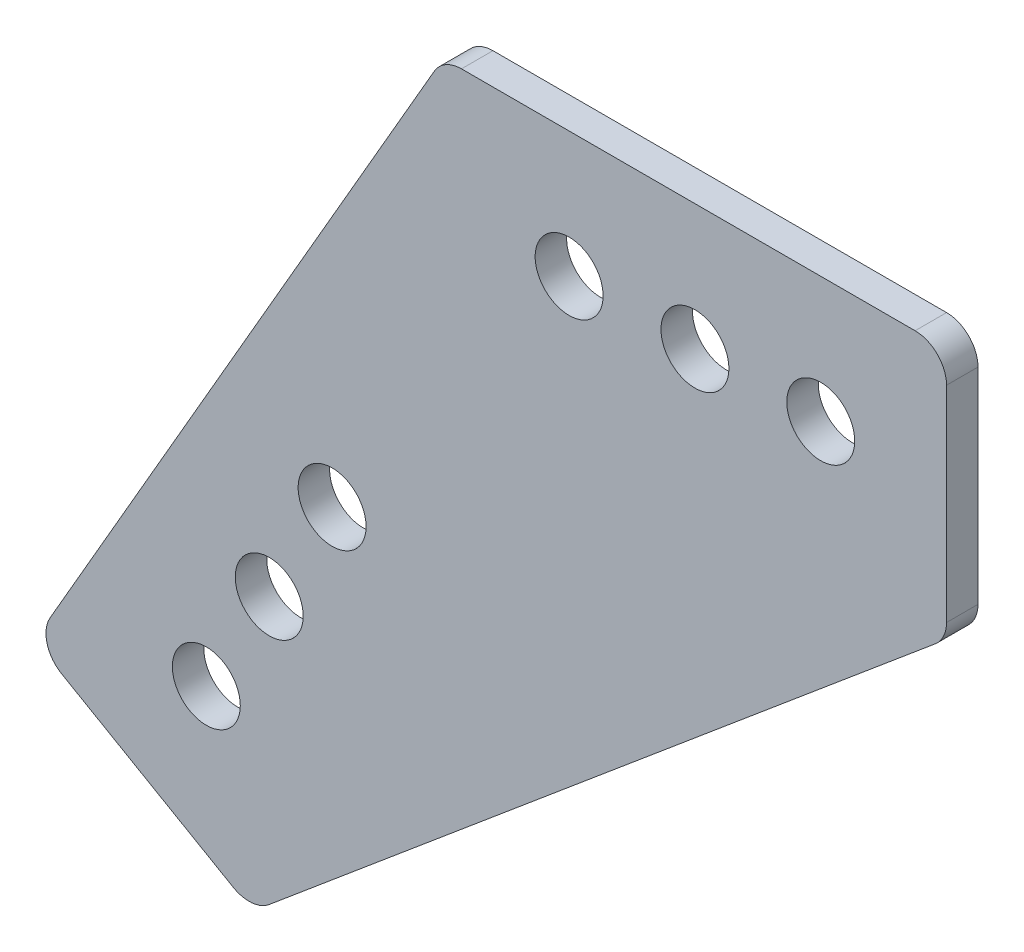
ISO-10303-21;
HEADER;
FILE_DESCRIPTION(('STEP AP214'),'2;1');
FILE_NAME('part.step','',(''),(''),'','','');
FILE_SCHEMA(('AUTOMOTIVE_DESIGN { 1 0 10303 214 1 1 1 1 }'));
ENDSEC;
DATA;
#1=APPLICATION_CONTEXT('core data for automotive mechanical design processes');
#2=APPLICATION_PROTOCOL_DEFINITION('international standard','automotive_design',2000,#1);
#3=PRODUCT_CONTEXT('',#1,'mechanical');
#4=PRODUCT('Part','Part','',(#3));
#5=PRODUCT_RELATED_PRODUCT_CATEGORY('part','',(#4));
#6=PRODUCT_DEFINITION_FORMATION('','',#4);
#7=PRODUCT_DEFINITION_CONTEXT('part definition',#1,'design');
#8=PRODUCT_DEFINITION('design','',#6,#7);
#9=PRODUCT_DEFINITION_SHAPE('','',#8);
#10=(LENGTH_UNIT() NAMED_UNIT(*) SI_UNIT(.MILLI.,.METRE.));
#11=(NAMED_UNIT(*) PLANE_ANGLE_UNIT() SI_UNIT($,.RADIAN.));
#12=(NAMED_UNIT(*) SI_UNIT($,.STERADIAN.) SOLID_ANGLE_UNIT());
#13=UNCERTAINTY_MEASURE_WITH_UNIT(LENGTH_MEASURE(1.E-05),#10,'distance_accuracy_value','');
#14=(GEOMETRIC_REPRESENTATION_CONTEXT(3) GLOBAL_UNCERTAINTY_ASSIGNED_CONTEXT((#13)) GLOBAL_UNIT_ASSIGNED_CONTEXT((#10,
#11,#12)) REPRESENTATION_CONTEXT('',''));
#15=CARTESIAN_POINT('',(0.,0.,0.));
#16=DIRECTION('',(0.,0.,1.));
#17=DIRECTION('',(1.,0.,0.));
#18=AXIS2_PLACEMENT_3D('',#15,#16,#17);
#19=CARTESIAN_POINT('',(0.,0.,3.175));
#20=DIRECTION('',(0.,0.,-1.));
#21=DIRECTION('',(-1.,0.,0.));
#22=AXIS2_PLACEMENT_3D('',#19,#20,#21);
#23=PLANE('',#22);
#24=DIRECTION('',(-0.500000000000004,-0.866025403784436,0.));
#25=VECTOR('',#24,1.);
#26=CARTESIAN_POINT('',(0.,0.,3.175));
#27=LINE('',#26,#25);
#28=CARTESIAN_POINT('',(-0.916543552338534,-1.58749999999999,3.175));
#29=VERTEX_POINT('',#28);
#30=CARTESIAN_POINT('',(-39.6875000000003,-68.7407664253897,3.175));
#31=VERTEX_POINT('',#30);
#32=EDGE_CURVE('E161',#29,#31,#27,.T.);
#33=ORIENTED_EDGE('',*,*,#32,.T.);
#34=CARTESIAN_POINT('',(-36.9378693429847,-70.3282664253897,3.175));
#35=DIRECTION('',(0.,0.,-1.));
#36=DIRECTION('',(-1.,0.,0.));
#37=AXIS2_PLACEMENT_3D('',#34,#35,#36);
#38=CIRCLE('',#37,3.175);
#39=CARTESIAN_POINT('',(-38.5253693429847,-73.0778970824052,3.175));
#40=VERTEX_POINT('',#39);
#41=EDGE_CURVE('E180',#31,#40,#38,.F.);
#42=ORIENTED_EDGE('',*,*,#41,.T.);
#43=DIRECTION('',(0.866025403784436,-0.500000000000004,0.));
#44=VECTOR('',#43,1.);
#45=CARTESIAN_POINT('',(-19.2779547438756,-84.1903970824053,3.175));
#46=LINE('',#45,#44);
#47=CARTESIAN_POINT('',(-21.2030611533773,-83.0789363786609,3.175));
#48=VERTEX_POINT('',#47);
#49=EDGE_CURVE('E140',#40,#48,#46,.T.);
#50=ORIENTED_EDGE('',*,*,#49,.T.);
#51=CARTESIAN_POINT('',(-19.6155611533773,-80.3293057216453,3.175));
#52=DIRECTION('',(0.,0.,-1.));
#53=DIRECTION('',(-1.,0.,0.));
#54=AXIS2_PLACEMENT_3D('',#51,#52,#53);
#55=CIRCLE('',#54,3.175);
#56=CARTESIAN_POINT('',(-17.5749546997371,-82.7617017217576,3.175));
#57=VERTEX_POINT('',#56);
#58=EDGE_CURVE('E178',#48,#57,#55,.F.);
#59=ORIENTED_EDGE('',*,*,#58,.T.);
#60=DIRECTION('',(0.766108976413314,0.642710694059889,0.));
#61=VECTOR('',#60,1.);
#62=CARTESIAN_POINT('',(-19.2779547438756,-84.1903970824053,3.175));
#63=LINE('',#62,#61);
#64=CARTESIAN_POINT('',(49.6656064536402,-26.3516751349545,3.175));
#65=VERTEX_POINT('',#64);
#66=EDGE_CURVE('E206',#57,#65,#63,.T.);
#67=ORIENTED_EDGE('',*,*,#66,.T.);
#68=CARTESIAN_POINT('',(47.625,-23.9192791348422,3.175));
#69=DIRECTION('',(0.,0.,-1.));
#70=DIRECTION('',(-1.,0.,0.));
#71=AXIS2_PLACEMENT_3D('',#68,#69,#70);
#72=CIRCLE('',#71,3.175);
#73=CARTESIAN_POINT('',(50.8,-23.9192791348422,3.175));
#74=VERTEX_POINT('',#73);
#75=EDGE_CURVE('E176',#65,#74,#72,.F.);
#76=ORIENTED_EDGE('',*,*,#75,.T.);
#77=DIRECTION('',(0.,1.,0.));
#78=VECTOR('',#77,1.);
#79=CARTESIAN_POINT('',(50.8,-25.4,3.175));
#80=LINE('',#79,#78);
#81=CARTESIAN_POINT('',(50.8,-3.175,3.175));
#82=VERTEX_POINT('',#81);
#83=EDGE_CURVE('E197',#74,#82,#80,.T.);
#84=ORIENTED_EDGE('',*,*,#83,.T.);
#85=CARTESIAN_POINT('',(47.625,-3.175,3.175));
#86=DIRECTION('',(0.,0.,-1.));
#87=DIRECTION('',(-1.,0.,0.));
#88=AXIS2_PLACEMENT_3D('',#85,#86,#87);
#89=CIRCLE('',#88,3.175);
#90=CARTESIAN_POINT('',(47.625,0.,3.175));
#91=VERTEX_POINT('',#90);
#92=EDGE_CURVE('E63',#82,#91,#89,.F.);
#93=ORIENTED_EDGE('',*,*,#92,.T.);
#94=DIRECTION('',(-1.,0.,0.));
#95=VECTOR('',#94,1.);
#96=CARTESIAN_POINT('',(0.,0.,3.175));
#97=LINE('',#96,#95);
#98=CARTESIAN_POINT('',(1.83308710467705,0.,3.175));
#99=VERTEX_POINT('',#98);
#100=EDGE_CURVE('E162',#91,#99,#97,.T.);
#101=ORIENTED_EDGE('',*,*,#100,.T.);
#102=CARTESIAN_POINT('',(1.83308710467705,-3.175,3.175));
#103=DIRECTION('',(0.,0.,-1.));
#104=DIRECTION('',(-1.,0.,0.));
#105=AXIS2_PLACEMENT_3D('',#102,#103,#104);
#106=CIRCLE('',#105,3.175);
#107=EDGE_CURVE('E173',#99,#29,#106,.F.);
#108=ORIENTED_EDGE('',*,*,#107,.T.);
#109=EDGE_LOOP('',(#33,#42,#50,#59,#67,#76,#84,#93,#101,#108));
#110=FACE_BOUND('',#109,.T.);
#111=CARTESIAN_POINT('',(38.1,-12.7,3.175));
#112=DIRECTION('',(0.,0.,1.));
#113=DIRECTION('',(1.,0.,0.));
#114=AXIS2_PLACEMENT_3D('',#111,#112,#113);
#115=CIRCLE('',#114,3.429);
#116=CARTESIAN_POINT('',(41.529,-12.7,3.175));
#117=VERTEX_POINT('',#116);
#118=EDGE_CURVE('E153',#117,#117,#115,.T.);
#119=ORIENTED_EDGE('',*,*,#118,.F.);
#120=EDGE_LOOP('',(#119));
#121=FACE_BOUND('',#120,.T.);
#122=CARTESIAN_POINT('',(25.4,-12.7000000000001,3.175));
#123=DIRECTION('',(0.,0.,1.));
#124=DIRECTION('',(1.,0.,0.));
#125=AXIS2_PLACEMENT_3D('',#122,#123,#124);
#126=CIRCLE('',#125,3.429);
#127=CARTESIAN_POINT('',(28.829,-12.7000000000001,3.175));
#128=VERTEX_POINT('',#127);
#129=EDGE_CURVE('E217',#128,#128,#126,.T.);
#130=ORIENTED_EDGE('',*,*,#129,.F.);
#131=EDGE_LOOP('',(#130));
#132=FACE_BOUND('',#131,.T.);
#133=CARTESIAN_POINT('',(12.7,-12.7000000000002,3.175));
#134=DIRECTION('',(0.,0.,1.));
#135=DIRECTION('',(1.,0.,0.));
#136=AXIS2_PLACEMENT_3D('',#133,#134,#135);
#137=CIRCLE('',#136,3.429);
#138=CARTESIAN_POINT('',(16.129,-12.7000000000002,3.175));
#139=VERTEX_POINT('',#138);
#140=EDGE_CURVE('E223',#139,#139,#137,.T.);
#141=ORIENTED_EDGE('',*,*,#140,.F.);
#142=EDGE_LOOP('',(#141));
#143=FACE_BOUND('',#142,.T.);
#144=CARTESIAN_POINT('',(-23.9264773719379,-66.8418744543429,3.175));
#145=DIRECTION('',(0.,0.,1.));
#146=DIRECTION('',(1.,0.,0.));
#147=AXIS2_PLACEMENT_3D('',#144,#145,#146);
#148=CIRCLE('',#147,3.42900000000001);
#149=CARTESIAN_POINT('',(-20.4974773719379,-66.8418744543429,3.175));
#150=VERTEX_POINT('',#149);
#151=EDGE_CURVE('E229',#150,#150,#148,.T.);
#152=ORIENTED_EDGE('',*,*,#151,.F.);
#153=EDGE_LOOP('',(#152));
#154=FACE_BOUND('',#153,.T.);
#155=CARTESIAN_POINT('',(-17.5764773719379,-55.8433518262806,3.175));
#156=DIRECTION('',(0.,0.,1.));
#157=DIRECTION('',(1.,0.,0.));
#158=AXIS2_PLACEMENT_3D('',#155,#156,#157);
#159=CIRCLE('',#158,3.42900000000001);
#160=CARTESIAN_POINT('',(-14.1474773719379,-55.8433518262806,3.175));
#161=VERTEX_POINT('',#160);
#162=EDGE_CURVE('E235',#161,#161,#159,.T.);
#163=ORIENTED_EDGE('',*,*,#162,.F.);
#164=EDGE_LOOP('',(#163));
#165=FACE_BOUND('',#164,.T.);
#166=CARTESIAN_POINT('',(-11.2264773719378,-44.8448291982183,3.175));
#167=DIRECTION('',(0.,0.,1.));
#168=DIRECTION('',(1.,0.,0.));
#169=AXIS2_PLACEMENT_3D('',#166,#167,#168);
#170=CIRCLE('',#169,3.429);
#171=CARTESIAN_POINT('',(-7.7974773719378,-44.8448291982183,3.175));
#172=VERTEX_POINT('',#171);
#173=EDGE_CURVE('E241',#172,#172,#170,.T.);
#174=ORIENTED_EDGE('',*,*,#173,.F.);
#175=EDGE_LOOP('',(#174));
#176=FACE_BOUND('',#175,.T.);
#177=ADVANCED_FACE('F42',(#110,#121,#132,#143,#154,#165,#176),#23,.F.);
#178=CARTESIAN_POINT('',(0.,0.,0.));
#179=DIRECTION('',(0.,0.,-1.));
#180=DIRECTION('',(-1.,0.,0.));
#181=AXIS2_PLACEMENT_3D('',#178,#179,#180);
#182=PLANE('',#181);
#183=CARTESIAN_POINT('',(-17.5764773719379,-55.8433518262806,0.));
#184=DIRECTION('',(0.,0.,1.));
#185=DIRECTION('',(1.,0.,0.));
#186=AXIS2_PLACEMENT_3D('',#183,#184,#185);
#187=CIRCLE('',#186,3.42900000000001);
#188=CARTESIAN_POINT('',(-14.1474773719379,-55.8433518262806,0.));
#189=VERTEX_POINT('',#188);
#190=EDGE_CURVE('E238',#189,#189,#187,.T.);
#191=ORIENTED_EDGE('',*,*,#190,.T.);
#192=EDGE_LOOP('',(#191));
#193=FACE_BOUND('',#192,.T.);
#194=CARTESIAN_POINT('',(12.7,-12.7000000000002,0.));
#195=DIRECTION('',(0.,0.,1.));
#196=DIRECTION('',(1.,0.,0.));
#197=AXIS2_PLACEMENT_3D('',#194,#195,#196);
#198=CIRCLE('',#197,3.429);
#199=CARTESIAN_POINT('',(16.129,-12.7000000000002,0.));
#200=VERTEX_POINT('',#199);
#201=EDGE_CURVE('E226',#200,#200,#198,.T.);
#202=ORIENTED_EDGE('',*,*,#201,.T.);
#203=EDGE_LOOP('',(#202));
#204=FACE_BOUND('',#203,.T.);
#205=CARTESIAN_POINT('',(38.1,-12.7,0.));
#206=DIRECTION('',(0.,0.,1.));
#207=DIRECTION('',(1.,0.,0.));
#208=AXIS2_PLACEMENT_3D('',#205,#206,#207);
#209=CIRCLE('',#208,3.429);
#210=CARTESIAN_POINT('',(41.529,-12.7,0.));
#211=VERTEX_POINT('',#210);
#212=EDGE_CURVE('E214',#211,#211,#209,.T.);
#213=ORIENTED_EDGE('',*,*,#212,.T.);
#214=EDGE_LOOP('',(#213));
#215=FACE_BOUND('',#214,.T.);
#216=DIRECTION('',(0.866025403784436,-0.500000000000004,0.));
#217=VECTOR('',#216,1.);
#218=CARTESIAN_POINT('',(-19.2779547438756,-84.1903970824053,0.));
#219=LINE('',#218,#217);
#220=CARTESIAN_POINT('',(-38.5253693429847,-73.0778970824052,0.));
#221=VERTEX_POINT('',#220);
#222=CARTESIAN_POINT('',(-21.2030611533773,-83.0789363786609,0.));
#223=VERTEX_POINT('',#222);
#224=EDGE_CURVE('E137',#221,#223,#219,.T.);
#225=ORIENTED_EDGE('',*,*,#224,.F.);
#226=CARTESIAN_POINT('',(-36.9378693429847,-70.3282664253897,0.));
#227=DIRECTION('',(0.,0.,-1.));
#228=DIRECTION('',(-1.,0.,0.));
#229=AXIS2_PLACEMENT_3D('',#226,#227,#228);
#230=CIRCLE('',#229,3.175);
#231=CARTESIAN_POINT('',(-39.6875000000003,-68.7407664253897,0.));
#232=VERTEX_POINT('',#231);
#233=EDGE_CURVE('E120',#221,#232,#230,.T.);
#234=ORIENTED_EDGE('',*,*,#233,.T.);
#235=DIRECTION('',(-0.500000000000004,-0.866025403784436,0.));
#236=VECTOR('',#235,1.);
#237=CARTESIAN_POINT('',(0.,0.,0.));
#238=LINE('',#237,#236);
#239=CARTESIAN_POINT('',(-0.916543552338534,-1.58749999999999,0.));
#240=VERTEX_POINT('',#239);
#241=EDGE_CURVE('E148',#240,#232,#238,.T.);
#242=ORIENTED_EDGE('',*,*,#241,.F.);
#243=CARTESIAN_POINT('',(1.83308710467705,-3.175,0.));
#244=DIRECTION('',(0.,0.,-1.));
#245=DIRECTION('',(-1.,0.,0.));
#246=AXIS2_PLACEMENT_3D('',#243,#244,#245);
#247=CIRCLE('',#246,3.175);
#248=CARTESIAN_POINT('',(1.83308710467705,0.,0.));
#249=VERTEX_POINT('',#248);
#250=EDGE_CURVE('E141',#240,#249,#247,.T.);
#251=ORIENTED_EDGE('',*,*,#250,.T.);
#252=DIRECTION('',(-1.,0.,0.));
#253=VECTOR('',#252,1.);
#254=CARTESIAN_POINT('',(0.,0.,0.));
#255=LINE('',#254,#253);
#256=CARTESIAN_POINT('',(47.625,0.,0.));
#257=VERTEX_POINT('',#256);
#258=EDGE_CURVE('E159',#257,#249,#255,.T.);
#259=ORIENTED_EDGE('',*,*,#258,.F.);
#260=CARTESIAN_POINT('',(47.625,-3.175,0.));
#261=DIRECTION('',(0.,0.,-1.));
#262=DIRECTION('',(-1.,0.,0.));
#263=AXIS2_PLACEMENT_3D('',#260,#261,#262);
#264=CIRCLE('',#263,3.175);
#265=CARTESIAN_POINT('',(50.8,-3.175,0.));
#266=VERTEX_POINT('',#265);
#267=EDGE_CURVE('E165',#257,#266,#264,.T.);
#268=ORIENTED_EDGE('',*,*,#267,.T.);
#269=DIRECTION('',(0.,1.,0.));
#270=VECTOR('',#269,1.);
#271=CARTESIAN_POINT('',(50.8,-25.4,0.));
#272=LINE('',#271,#270);
#273=CARTESIAN_POINT('',(50.8,-23.9192791348422,0.));
#274=VERTEX_POINT('',#273);
#275=EDGE_CURVE('E151',#274,#266,#272,.T.);
#276=ORIENTED_EDGE('',*,*,#275,.F.);
#277=CARTESIAN_POINT('',(47.625,-23.9192791348422,0.));
#278=DIRECTION('',(0.,0.,-1.));
#279=DIRECTION('',(-1.,0.,0.));
#280=AXIS2_PLACEMENT_3D('',#277,#278,#279);
#281=CIRCLE('',#280,3.175);
#282=CARTESIAN_POINT('',(49.6656064536402,-26.3516751349545,0.));
#283=VERTEX_POINT('',#282);
#284=EDGE_CURVE('E167',#274,#283,#281,.T.);
#285=ORIENTED_EDGE('',*,*,#284,.T.);
#286=DIRECTION('',(0.766108976413314,0.642710694059889,0.));
#287=VECTOR('',#286,1.);
#288=CARTESIAN_POINT('',(-19.2779547438756,-84.1903970824053,0.));
#289=LINE('',#288,#287);
#290=CARTESIAN_POINT('',(-17.5749546997371,-82.7617017217576,0.));
#291=VERTEX_POINT('',#290);
#292=EDGE_CURVE('E147',#291,#283,#289,.T.);
#293=ORIENTED_EDGE('',*,*,#292,.F.);
#294=CARTESIAN_POINT('',(-19.6155611533773,-80.3293057216453,0.));
#295=DIRECTION('',(0.,0.,-1.));
#296=DIRECTION('',(-1.,0.,0.));
#297=AXIS2_PLACEMENT_3D('',#294,#295,#296);
#298=CIRCLE('',#297,3.175);
#299=EDGE_CURVE('E131',#291,#223,#298,.T.);
#300=ORIENTED_EDGE('',*,*,#299,.T.);
#301=EDGE_LOOP('',(#225,#234,#242,#251,#259,#268,#276,#285,#293,#300));
#302=FACE_BOUND('',#301,.T.);
#303=CARTESIAN_POINT('',(25.4,-12.7000000000001,0.));
#304=DIRECTION('',(0.,0.,1.));
#305=DIRECTION('',(1.,0.,0.));
#306=AXIS2_PLACEMENT_3D('',#303,#304,#305);
#307=CIRCLE('',#306,3.429);
#308=CARTESIAN_POINT('',(28.829,-12.7000000000001,0.));
#309=VERTEX_POINT('',#308);
#310=EDGE_CURVE('E220',#309,#309,#307,.T.);
#311=ORIENTED_EDGE('',*,*,#310,.T.);
#312=EDGE_LOOP('',(#311));
#313=FACE_BOUND('',#312,.T.);
#314=CARTESIAN_POINT('',(-23.9264773719379,-66.8418744543429,0.));
#315=DIRECTION('',(0.,0.,1.));
#316=DIRECTION('',(1.,0.,0.));
#317=AXIS2_PLACEMENT_3D('',#314,#315,#316);
#318=CIRCLE('',#317,3.42900000000001);
#319=CARTESIAN_POINT('',(-20.4974773719379,-66.8418744543429,0.));
#320=VERTEX_POINT('',#319);
#321=EDGE_CURVE('E232',#320,#320,#318,.T.);
#322=ORIENTED_EDGE('',*,*,#321,.T.);
#323=EDGE_LOOP('',(#322));
#324=FACE_BOUND('',#323,.T.);
#325=CARTESIAN_POINT('',(-11.2264773719378,-44.8448291982183,0.));
#326=DIRECTION('',(0.,0.,1.));
#327=DIRECTION('',(1.,0.,0.));
#328=AXIS2_PLACEMENT_3D('',#325,#326,#327);
#329=CIRCLE('',#328,3.429);
#330=CARTESIAN_POINT('',(-7.7974773719378,-44.8448291982183,0.));
#331=VERTEX_POINT('',#330);
#332=EDGE_CURVE('E244',#331,#331,#329,.T.);
#333=ORIENTED_EDGE('',*,*,#332,.T.);
#334=EDGE_LOOP('',(#333));
#335=FACE_BOUND('',#334,.T.);
#336=ADVANCED_FACE('F144',(#193,#204,#215,#302,#313,#324,#335),#182,.T.);
#337=CARTESIAN_POINT('',(0.,0.,3.175));
#338=DIRECTION('',(0.866025403784436,-0.500000000000004,0.));
#339=DIRECTION('',(0.500000000000004,0.866025403784436,0.));
#340=AXIS2_PLACEMENT_3D('',#337,#338,#339);
#341=PLANE('',#340);
#342=ORIENTED_EDGE('',*,*,#241,.T.);
#343=DIRECTION('',(0.,0.,-1.));
#344=VECTOR('',#343,1.);
#345=CARTESIAN_POINT('',(-39.6875000000003,-68.7407664253896,3.175));
#346=LINE('',#345,#344);
#347=EDGE_CURVE('E125',#232,#31,#346,.F.);
#348=ORIENTED_EDGE('',*,*,#347,.T.);
#349=ORIENTED_EDGE('',*,*,#32,.F.);
#350=DIRECTION('',(0.,0.,-1.));
#351=VECTOR('',#350,1.);
#352=CARTESIAN_POINT('',(-0.916543552338533,-1.58749999999999,3.175));
#353=LINE('',#352,#351);
#354=EDGE_CURVE('E130',#29,#240,#353,.T.);
#355=ORIENTED_EDGE('',*,*,#354,.T.);
#356=EDGE_LOOP('',(#342,#348,#349,#355));
#357=FACE_BOUND('',#356,.T.);
#358=ADVANCED_FACE('F259',(#357),#341,.F.);
#359=CARTESIAN_POINT('',(-19.2779547438756,-84.1903970824053,3.175));
#360=DIRECTION('',(0.500000000000004,0.866025403784436,0.));
#361=DIRECTION('',(-0.866025403784437,0.500000000000004,0.));
#362=AXIS2_PLACEMENT_3D('',#359,#360,#361);
#363=PLANE('',#362);
#364=ORIENTED_EDGE('',*,*,#49,.F.);
#365=DIRECTION('',(0.,0.,-1.));
#366=VECTOR('',#365,1.);
#367=CARTESIAN_POINT('',(-38.5253693429847,-73.0778970824052,3.175));
#368=LINE('',#367,#366);
#369=EDGE_CURVE('E124',#40,#221,#368,.T.);
#370=ORIENTED_EDGE('',*,*,#369,.T.);
#371=ORIENTED_EDGE('',*,*,#224,.T.);
#372=DIRECTION('',(0.,0.,-1.));
#373=VECTOR('',#372,1.);
#374=CARTESIAN_POINT('',(-21.2030611533773,-83.0789363786609,3.175));
#375=LINE('',#374,#373);
#376=EDGE_CURVE('E142',#223,#48,#375,.F.);
#377=ORIENTED_EDGE('',*,*,#376,.T.);
#378=EDGE_LOOP('',(#364,#370,#371,#377));
#379=FACE_BOUND('',#378,.T.);
#380=ADVANCED_FACE('F136',(#379),#363,.F.);
#381=CARTESIAN_POINT('',(-19.2779547438756,-84.1903970824053,3.175));
#382=DIRECTION('',(-0.642710694059889,0.766108976413314,0.));
#383=DIRECTION('',(-0.766108976413314,-0.642710694059889,0.));
#384=AXIS2_PLACEMENT_3D('',#381,#382,#383);
#385=PLANE('',#384);
#386=ORIENTED_EDGE('',*,*,#66,.F.);
#387=DIRECTION('',(0.,0.,-1.));
#388=VECTOR('',#387,1.);
#389=CARTESIAN_POINT('',(-17.5749546997371,-82.7617017217576,3.175));
#390=LINE('',#389,#388);
#391=EDGE_CURVE('E184',#57,#291,#390,.T.);
#392=ORIENTED_EDGE('',*,*,#391,.T.);
#393=ORIENTED_EDGE('',*,*,#292,.T.);
#394=DIRECTION('',(0.,0.,-1.));
#395=VECTOR('',#394,1.);
#396=CARTESIAN_POINT('',(49.6656064536402,-26.3516751349545,3.175));
#397=LINE('',#396,#395);
#398=EDGE_CURVE('E182',#283,#65,#397,.F.);
#399=ORIENTED_EDGE('',*,*,#398,.T.);
#400=EDGE_LOOP('',(#386,#392,#393,#399));
#401=FACE_BOUND('',#400,.T.);
#402=ADVANCED_FACE('F271',(#401),#385,.F.);
#403=CARTESIAN_POINT('',(50.8,-25.4,3.175));
#404=DIRECTION('',(-1.,0.,0.));
#405=DIRECTION('',(0.,0.,1.));
#406=AXIS2_PLACEMENT_3D('',#403,#404,#405);
#407=PLANE('',#406);
#408=ORIENTED_EDGE('',*,*,#83,.F.);
#409=DIRECTION('',(0.,0.,-1.));
#410=VECTOR('',#409,1.);
#411=CARTESIAN_POINT('',(50.8,-23.9192791348422,3.175));
#412=LINE('',#411,#410);
#413=EDGE_CURVE('E189',#74,#274,#412,.T.);
#414=ORIENTED_EDGE('',*,*,#413,.T.);
#415=ORIENTED_EDGE('',*,*,#275,.T.);
#416=DIRECTION('',(0.,0.,-1.));
#417=VECTOR('',#416,1.);
#418=CARTESIAN_POINT('',(50.8,-3.175,3.175));
#419=LINE('',#418,#417);
#420=EDGE_CURVE('E187',#266,#82,#419,.F.);
#421=ORIENTED_EDGE('',*,*,#420,.T.);
#422=EDGE_LOOP('',(#408,#414,#415,#421));
#423=FACE_BOUND('',#422,.T.);
#424=ADVANCED_FACE('F195',(#423),#407,.F.);
#425=CARTESIAN_POINT('',(0.,0.,3.175));
#426=DIRECTION('',(0.,-1.,0.));
#427=DIRECTION('',(0.,0.,-1.));
#428=AXIS2_PLACEMENT_3D('',#425,#426,#427);
#429=PLANE('',#428);
#430=ORIENTED_EDGE('',*,*,#100,.F.);
#431=DIRECTION('',(0.,0.,-1.));
#432=VECTOR('',#431,1.);
#433=CARTESIAN_POINT('',(47.625,0.,3.175));
#434=LINE('',#433,#432);
#435=EDGE_CURVE('E11',#91,#257,#434,.T.);
#436=ORIENTED_EDGE('',*,*,#435,.T.);
#437=ORIENTED_EDGE('',*,*,#258,.T.);
#438=DIRECTION('',(0.,0.,-1.));
#439=VECTOR('',#438,1.);
#440=CARTESIAN_POINT('',(1.83308710467705,0.,3.175));
#441=LINE('',#440,#439);
#442=EDGE_CURVE('E50',#249,#99,#441,.F.);
#443=ORIENTED_EDGE('',*,*,#442,.T.);
#444=EDGE_LOOP('',(#430,#436,#437,#443));
#445=FACE_BOUND('',#444,.T.);
#446=ADVANCED_FACE('F204',(#445),#429,.F.);
#447=CARTESIAN_POINT('',(38.1,-12.7,3.175));
#448=DIRECTION('',(0.,0.,-1.));
#449=DIRECTION('',(-1.,0.,0.));
#450=AXIS2_PLACEMENT_3D('',#447,#448,#449);
#451=CYLINDRICAL_SURFACE('',#450,3.429);
#452=ORIENTED_EDGE('',*,*,#118,.T.);
#453=EDGE_LOOP('',(#452));
#454=FACE_BOUND('',#453,.T.);
#455=ORIENTED_EDGE('',*,*,#212,.F.);
#456=EDGE_LOOP('',(#455));
#457=FACE_BOUND('',#456,.T.);
#458=ADVANCED_FACE('F264',(#454,#457),#451,.F.);
#459=CARTESIAN_POINT('',(25.4,-12.7000000000001,3.175));
#460=DIRECTION('',(0.,0.,-1.));
#461=DIRECTION('',(-1.,0.,0.));
#462=AXIS2_PLACEMENT_3D('',#459,#460,#461);
#463=CYLINDRICAL_SURFACE('',#462,3.429);
#464=ORIENTED_EDGE('',*,*,#129,.T.);
#465=EDGE_LOOP('',(#464));
#466=FACE_BOUND('',#465,.T.);
#467=ORIENTED_EDGE('',*,*,#310,.F.);
#468=EDGE_LOOP('',(#467));
#469=FACE_BOUND('',#468,.T.);
#470=ADVANCED_FACE('F393',(#466,#469),#463,.F.);
#471=CARTESIAN_POINT('',(12.7,-12.7000000000002,3.175));
#472=DIRECTION('',(0.,0.,-1.));
#473=DIRECTION('',(-1.,0.,0.));
#474=AXIS2_PLACEMENT_3D('',#471,#472,#473);
#475=CYLINDRICAL_SURFACE('',#474,3.429);
#476=ORIENTED_EDGE('',*,*,#140,.T.);
#477=EDGE_LOOP('',(#476));
#478=FACE_BOUND('',#477,.T.);
#479=ORIENTED_EDGE('',*,*,#201,.F.);
#480=EDGE_LOOP('',(#479));
#481=FACE_BOUND('',#480,.T.);
#482=ADVANCED_FACE('F402',(#478,#481),#475,.F.);
#483=CARTESIAN_POINT('',(-23.9264773719379,-66.8418744543429,3.175));
#484=DIRECTION('',(0.,0.,-1.));
#485=DIRECTION('',(-1.,0.,0.));
#486=AXIS2_PLACEMENT_3D('',#483,#484,#485);
#487=CYLINDRICAL_SURFACE('',#486,3.42900000000001);
#488=ORIENTED_EDGE('',*,*,#151,.T.);
#489=EDGE_LOOP('',(#488));
#490=FACE_BOUND('',#489,.T.);
#491=ORIENTED_EDGE('',*,*,#321,.F.);
#492=EDGE_LOOP('',(#491));
#493=FACE_BOUND('',#492,.T.);
#494=ADVANCED_FACE('F411',(#490,#493),#487,.F.);
#495=CARTESIAN_POINT('',(-17.5764773719379,-55.8433518262806,3.175));
#496=DIRECTION('',(0.,0.,-1.));
#497=DIRECTION('',(-1.,0.,0.));
#498=AXIS2_PLACEMENT_3D('',#495,#496,#497);
#499=CYLINDRICAL_SURFACE('',#498,3.42900000000001);
#500=ORIENTED_EDGE('',*,*,#162,.T.);
#501=EDGE_LOOP('',(#500));
#502=FACE_BOUND('',#501,.T.);
#503=ORIENTED_EDGE('',*,*,#190,.F.);
#504=EDGE_LOOP('',(#503));
#505=FACE_BOUND('',#504,.T.);
#506=ADVANCED_FACE('F421',(#502,#505),#499,.F.);
#507=CARTESIAN_POINT('',(-11.2264773719378,-44.8448291982183,3.175));
#508=DIRECTION('',(0.,0.,-1.));
#509=DIRECTION('',(-1.,0.,0.));
#510=AXIS2_PLACEMENT_3D('',#507,#508,#509);
#511=CYLINDRICAL_SURFACE('',#510,3.429);
#512=ORIENTED_EDGE('',*,*,#173,.T.);
#513=EDGE_LOOP('',(#512));
#514=FACE_BOUND('',#513,.T.);
#515=ORIENTED_EDGE('',*,*,#332,.F.);
#516=EDGE_LOOP('',(#515));
#517=FACE_BOUND('',#516,.T.);
#518=ADVANCED_FACE('F250',(#514,#517),#511,.F.);
#519=CARTESIAN_POINT('',(-36.9378693429847,-70.3282664253897,3.175));
#520=DIRECTION('',(0.,0.,-1.));
#521=DIRECTION('',(-1.,0.,0.));
#522=AXIS2_PLACEMENT_3D('',#519,#520,#521);
#523=CYLINDRICAL_SURFACE('',#522,3.175);
#524=ORIENTED_EDGE('',*,*,#41,.F.);
#525=ORIENTED_EDGE('',*,*,#347,.F.);
#526=ORIENTED_EDGE('',*,*,#233,.F.);
#527=ORIENTED_EDGE('',*,*,#369,.F.);
#528=EDGE_LOOP('',(#524,#525,#526,#527));
#529=FACE_BOUND('',#528,.T.);
#530=ADVANCED_FACE('F123',(#529),#523,.T.);
#531=CARTESIAN_POINT('',(-19.6155611533773,-80.3293057216453,3.175));
#532=DIRECTION('',(0.,0.,-1.));
#533=DIRECTION('',(-1.,0.,0.));
#534=AXIS2_PLACEMENT_3D('',#531,#532,#533);
#535=CYLINDRICAL_SURFACE('',#534,3.175);
#536=ORIENTED_EDGE('',*,*,#58,.F.);
#537=ORIENTED_EDGE('',*,*,#376,.F.);
#538=ORIENTED_EDGE('',*,*,#299,.F.);
#539=ORIENTED_EDGE('',*,*,#391,.F.);
#540=EDGE_LOOP('',(#536,#537,#538,#539));
#541=FACE_BOUND('',#540,.T.);
#542=ADVANCED_FACE('F282',(#541),#535,.T.);
#543=CARTESIAN_POINT('',(47.625,-23.9192791348422,3.175));
#544=DIRECTION('',(0.,0.,-1.));
#545=DIRECTION('',(-1.,0.,0.));
#546=AXIS2_PLACEMENT_3D('',#543,#544,#545);
#547=CYLINDRICAL_SURFACE('',#546,3.175);
#548=ORIENTED_EDGE('',*,*,#75,.F.);
#549=ORIENTED_EDGE('',*,*,#398,.F.);
#550=ORIENTED_EDGE('',*,*,#284,.F.);
#551=ORIENTED_EDGE('',*,*,#413,.F.);
#552=EDGE_LOOP('',(#548,#549,#550,#551));
#553=FACE_BOUND('',#552,.T.);
#554=ADVANCED_FACE('F285',(#553),#547,.T.);
#555=CARTESIAN_POINT('',(47.625,-3.175,3.175));
#556=DIRECTION('',(0.,0.,-1.));
#557=DIRECTION('',(-1.,0.,0.));
#558=AXIS2_PLACEMENT_3D('',#555,#556,#557);
#559=CYLINDRICAL_SURFACE('',#558,3.175);
#560=ORIENTED_EDGE('',*,*,#92,.F.);
#561=ORIENTED_EDGE('',*,*,#420,.F.);
#562=ORIENTED_EDGE('',*,*,#267,.F.);
#563=ORIENTED_EDGE('',*,*,#435,.F.);
#564=EDGE_LOOP('',(#560,#561,#562,#563));
#565=FACE_BOUND('',#564,.T.);
#566=ADVANCED_FACE('F203',(#565),#559,.T.);
#567=CARTESIAN_POINT('',(1.83308710467705,-3.175,3.175));
#568=DIRECTION('',(0.,0.,-1.));
#569=DIRECTION('',(-1.,0.,0.));
#570=AXIS2_PLACEMENT_3D('',#567,#568,#569);
#571=CYLINDRICAL_SURFACE('',#570,3.175);
#572=ORIENTED_EDGE('',*,*,#107,.F.);
#573=ORIENTED_EDGE('',*,*,#442,.F.);
#574=ORIENTED_EDGE('',*,*,#250,.F.);
#575=ORIENTED_EDGE('',*,*,#354,.F.);
#576=EDGE_LOOP('',(#572,#573,#574,#575));
#577=FACE_BOUND('',#576,.T.);
#578=ADVANCED_FACE('F44',(#577),#571,.T.);
#579=CLOSED_SHELL('',(#177,#336,#358,#380,#402,#424,#446,#458,#470,#482,#494,#506,#518,#530,
#542,#554,#566,#578));
#580=MANIFOLD_SOLID_BREP('B2',#579);
#581=ADVANCED_BREP_SHAPE_REPRESENTATION('',(#18,#580),#14);
#582=SHAPE_DEFINITION_REPRESENTATION(#9,#581);
ENDSEC;
END-ISO-10303-21;
